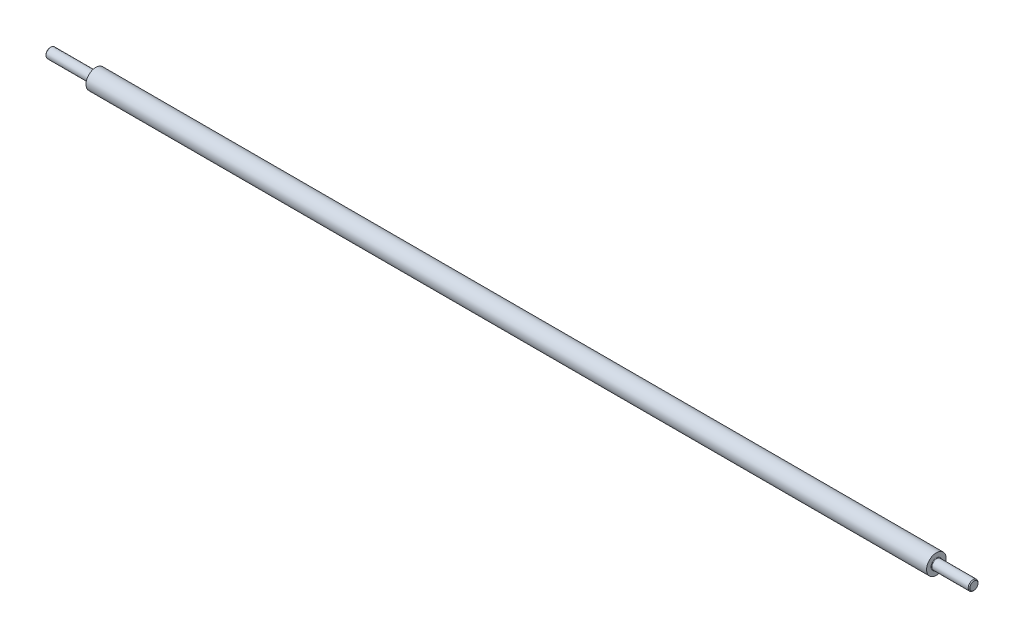
ISO-10303-21;
HEADER;
FILE_DESCRIPTION(('STEP AP214'),'2;1');
FILE_NAME('part.step','',(''),(''),'','','');
FILE_SCHEMA(('AUTOMOTIVE_DESIGN { 1 0 10303 214 1 1 1 1 }'));
ENDSEC;
DATA;
#1=APPLICATION_CONTEXT('core data for automotive mechanical design processes');
#2=APPLICATION_PROTOCOL_DEFINITION('international standard','automotive_design',2000,#1);
#3=PRODUCT_CONTEXT('',#1,'mechanical');
#4=PRODUCT('Part','Part','',(#3));
#5=PRODUCT_RELATED_PRODUCT_CATEGORY('part','',(#4));
#6=PRODUCT_DEFINITION_FORMATION('','',#4);
#7=PRODUCT_DEFINITION_CONTEXT('part definition',#1,'design');
#8=PRODUCT_DEFINITION('design','',#6,#7);
#9=PRODUCT_DEFINITION_SHAPE('','',#8);
#10=(LENGTH_UNIT() NAMED_UNIT(*) SI_UNIT(.MILLI.,.METRE.));
#11=(NAMED_UNIT(*) PLANE_ANGLE_UNIT() SI_UNIT($,.RADIAN.));
#12=(NAMED_UNIT(*) SI_UNIT($,.STERADIAN.) SOLID_ANGLE_UNIT());
#13=UNCERTAINTY_MEASURE_WITH_UNIT(LENGTH_MEASURE(1.E-05),#10,'distance_accuracy_value','');
#14=(GEOMETRIC_REPRESENTATION_CONTEXT(3) GLOBAL_UNCERTAINTY_ASSIGNED_CONTEXT((#13)) GLOBAL_UNIT_ASSIGNED_CONTEXT((#10,
#11,#12)) REPRESENTATION_CONTEXT('',''));
#15=CARTESIAN_POINT('',(0.,0.,0.));
#16=DIRECTION('',(0.,0.,1.));
#17=DIRECTION('',(1.,0.,0.));
#18=AXIS2_PLACEMENT_3D('',#15,#16,#17);
#19=CARTESIAN_POINT('',(-93.6000000000001,57.57,0.));
#20=DIRECTION('',(1.,0.,0.));
#21=DIRECTION('',(0.,1.,0.));
#22=AXIS2_PLACEMENT_3D('',#19,#20,#21);
#23=PLANE('',#22);
#24=CARTESIAN_POINT('',(-93.6000000000001,51.57,0.));
#25=DIRECTION('',(1.,0.,0.));
#26=DIRECTION('',(0.,1.,0.));
#27=AXIS2_PLACEMENT_3D('',#24,#25,#26);
#28=CIRCLE('',#27,3.29999999999997);
#29=CARTESIAN_POINT('',(-93.6000000000001,54.87,0.));
#30=VERTEX_POINT('',#29);
#31=EDGE_CURVE('E11',#30,#30,#28,.F.);
#32=ORIENTED_EDGE('',*,*,#31,.T.);
#33=EDGE_LOOP('',(#32));
#34=FACE_BOUND('',#33,.T.);
#35=CARTESIAN_POINT('',(-93.6000000000001,51.57,0.));
#36=DIRECTION('',(1.,0.,0.));
#37=DIRECTION('',(0.,1.,0.));
#38=AXIS2_PLACEMENT_3D('',#35,#36,#37);
#39=CIRCLE('',#38,5.99999999999998);
#40=CARTESIAN_POINT('',(-93.6000000000001,57.57,0.));
#41=VERTEX_POINT('',#40);
#42=EDGE_CURVE('E77',#41,#41,#39,.T.);
#43=ORIENTED_EDGE('',*,*,#42,.T.);
#44=EDGE_LOOP('',(#43));
#45=FACE_BOUND('',#44,.T.);
#46=ADVANCED_FACE('F45',(#34,#45),#23,.T.);
#47=CARTESIAN_POINT('',(-24.9606577642965,51.57,0.));
#48=DIRECTION('',(1.,0.,0.));
#49=DIRECTION('',(0.,1.,0.));
#50=AXIS2_PLACEMENT_3D('',#47,#48,#49);
#51=CYLINDRICAL_SURFACE('',#50,5.99999999999997);
#52=CARTESIAN_POINT('',(-608.6,51.57,0.));
#53=DIRECTION('',(1.,0.,0.));
#54=DIRECTION('',(0.,1.,0.));
#55=AXIS2_PLACEMENT_3D('',#52,#53,#54);
#56=CIRCLE('',#55,5.99999999999997);
#57=CARTESIAN_POINT('',(-608.6,57.5699999999999,0.));
#58=VERTEX_POINT('',#57);
#59=EDGE_CURVE('E80',#58,#58,#56,.T.);
#60=ORIENTED_EDGE('',*,*,#59,.T.);
#61=EDGE_LOOP('',(#60));
#62=FACE_BOUND('',#61,.T.);
#63=ORIENTED_EDGE('',*,*,#42,.F.);
#64=EDGE_LOOP('',(#63));
#65=FACE_BOUND('',#64,.T.);
#66=ADVANCED_FACE('F84',(#62,#65),#51,.T.);
#67=CARTESIAN_POINT('',(-608.6,57.5699999999999,0.));
#68=DIRECTION('',(-1.,0.,0.));
#69=DIRECTION('',(0.,-1.,0.));
#70=AXIS2_PLACEMENT_3D('',#67,#68,#69);
#71=PLANE('',#70);
#72=CARTESIAN_POINT('',(-608.6,51.57,0.));
#73=DIRECTION('',(-1.,0.,0.));
#74=DIRECTION('',(0.,-1.,0.));
#75=AXIS2_PLACEMENT_3D('',#72,#73,#74);
#76=CIRCLE('',#75,3.29999999999988);
#77=CARTESIAN_POINT('',(-608.6,48.2700000000001,0.));
#78=VERTEX_POINT('',#77);
#79=EDGE_CURVE('E60',#78,#78,#76,.F.);
#80=ORIENTED_EDGE('',*,*,#79,.T.);
#81=EDGE_LOOP('',(#80));
#82=FACE_BOUND('',#81,.T.);
#83=ORIENTED_EDGE('',*,*,#59,.F.);
#84=EDGE_LOOP('',(#83));
#85=FACE_BOUND('',#84,.T.);
#86=ADVANCED_FACE('F87',(#82,#85),#71,.T.);
#87=CARTESIAN_POINT('',(-24.9606577642965,51.57,0.));
#88=DIRECTION('',(1.,0.,0.));
#89=DIRECTION('',(0.,1.,0.));
#90=AXIS2_PLACEMENT_3D('',#87,#88,#89);
#91=CYLINDRICAL_SURFACE('',#90,2.99999999999988);
#92=CARTESIAN_POINT('',(-608.9,51.57,0.));
#93=DIRECTION('',(-1.,0.,0.));
#94=DIRECTION('',(0.,-1.,0.));
#95=AXIS2_PLACEMENT_3D('',#92,#93,#94);
#96=CIRCLE('',#95,2.99999999999988);
#97=CARTESIAN_POINT('',(-608.9,48.5700000000001,0.));
#98=VERTEX_POINT('',#97);
#99=EDGE_CURVE('E56',#98,#98,#96,.T.);
#100=ORIENTED_EDGE('',*,*,#99,.T.);
#101=EDGE_LOOP('',(#100));
#102=FACE_BOUND('',#101,.T.);
#103=CARTESIAN_POINT('',(-636.1,51.57,0.));
#104=DIRECTION('',(-1.,0.,0.));
#105=DIRECTION('',(0.,0.,1.));
#106=AXIS2_PLACEMENT_3D('',#103,#104,#105);
#107=CIRCLE('',#106,2.99999999999988);
#108=CARTESIAN_POINT('',(-636.1,51.57,2.99999999999988));
#109=VERTEX_POINT('',#108);
#110=EDGE_CURVE('E68',#109,#109,#107,.F.);
#111=ORIENTED_EDGE('',*,*,#110,.T.);
#112=EDGE_LOOP('',(#111));
#113=FACE_BOUND('',#112,.T.);
#114=ADVANCED_FACE('F89',(#102,#113),#91,.T.);
#115=CARTESIAN_POINT('',(-636.6,54.5699999999999,0.));
#116=DIRECTION('',(-1.,0.,0.));
#117=DIRECTION('',(0.,-1.,0.));
#118=AXIS2_PLACEMENT_3D('',#115,#116,#117);
#119=PLANE('',#118);
#120=CARTESIAN_POINT('',(-636.6,51.57,0.));
#121=DIRECTION('',(-1.,0.,0.));
#122=DIRECTION('',(0.,-1.,0.));
#123=AXIS2_PLACEMENT_3D('',#120,#121,#122);
#124=CIRCLE('',#123,2.49999999999977);
#125=CARTESIAN_POINT('',(-636.6,49.0700000000002,0.));
#126=VERTEX_POINT('',#125);
#127=EDGE_CURVE('E65',#126,#126,#124,.T.);
#128=ORIENTED_EDGE('',*,*,#127,.T.);
#129=EDGE_LOOP('',(#128));
#130=FACE_BOUND('',#129,.T.);
#131=ADVANCED_FACE('F96',(#130),#119,.T.);
#132=CARTESIAN_POINT('',(-70.6000000000001,54.57,0.));
#133=DIRECTION('',(1.,0.,0.));
#134=DIRECTION('',(0.,1.,0.));
#135=AXIS2_PLACEMENT_3D('',#132,#133,#134);
#136=PLANE('',#135);
#137=CARTESIAN_POINT('',(-70.6000000000001,51.57,0.));
#138=DIRECTION('',(1.,0.,0.));
#139=DIRECTION('',(0.,1.,0.));
#140=AXIS2_PLACEMENT_3D('',#137,#138,#139);
#141=CIRCLE('',#140,2.49999999999995);
#142=CARTESIAN_POINT('',(-70.6000000000001,54.07,0.));
#143=VERTEX_POINT('',#142);
#144=EDGE_CURVE('E74',#143,#143,#141,.T.);
#145=ORIENTED_EDGE('',*,*,#144,.T.);
#146=EDGE_LOOP('',(#145));
#147=FACE_BOUND('',#146,.T.);
#148=ADVANCED_FACE('F144',(#147),#136,.T.);
#149=CARTESIAN_POINT('',(-24.9606577642965,51.57,0.));
#150=DIRECTION('',(1.,0.,0.));
#151=DIRECTION('',(0.,1.,0.));
#152=AXIS2_PLACEMENT_3D('',#149,#150,#151);
#153=CYLINDRICAL_SURFACE('',#152,2.99999999999998);
#154=CARTESIAN_POINT('',(-93.3000000000001,51.57,0.));
#155=DIRECTION('',(1.,0.,0.));
#156=DIRECTION('',(0.,1.,0.));
#157=AXIS2_PLACEMENT_3D('',#154,#155,#156);
#158=CIRCLE('',#157,2.99999999999998);
#159=CARTESIAN_POINT('',(-93.3000000000001,54.57,0.));
#160=VERTEX_POINT('',#159);
#161=EDGE_CURVE('E52',#160,#160,#158,.T.);
#162=ORIENTED_EDGE('',*,*,#161,.T.);
#163=EDGE_LOOP('',(#162));
#164=FACE_BOUND('',#163,.T.);
#165=CARTESIAN_POINT('',(-71.1000000000002,51.57,0.));
#166=DIRECTION('',(1.,0.,0.));
#167=DIRECTION('',(0.,0.,-1.));
#168=AXIS2_PLACEMENT_3D('',#165,#166,#167);
#169=CIRCLE('',#168,2.99999999999998);
#170=CARTESIAN_POINT('',(-71.1000000000002,51.57,-2.99999999999998));
#171=VERTEX_POINT('',#170);
#172=EDGE_CURVE('E71',#171,#171,#169,.F.);
#173=ORIENTED_EDGE('',*,*,#172,.T.);
#174=EDGE_LOOP('',(#173));
#175=FACE_BOUND('',#174,.T.);
#176=ADVANCED_FACE('F110',(#164,#175),#153,.T.);
#177=CARTESIAN_POINT('',(-70.6000000000001,51.57,0.));
#178=DIRECTION('',(-1.,0.,0.));
#179=DIRECTION('',(0.,0.,1.));
#180=AXIS2_PLACEMENT_3D('',#177,#178,#179);
#181=CONICAL_SURFACE('',#180,2.49999999999995,0.78539816339746);
#182=ORIENTED_EDGE('',*,*,#172,.F.);
#183=EDGE_LOOP('',(#182));
#184=FACE_BOUND('',#183,.T.);
#185=ORIENTED_EDGE('',*,*,#144,.F.);
#186=EDGE_LOOP('',(#185));
#187=FACE_BOUND('',#186,.T.);
#188=ADVANCED_FACE('F106',(#184,#187),#181,.T.);
#189=CARTESIAN_POINT('',(-636.1,51.57,0.));
#190=DIRECTION('',(1.,0.,0.));
#191=DIRECTION('',(0.,0.,-1.));
#192=AXIS2_PLACEMENT_3D('',#189,#190,#191);
#193=CONICAL_SURFACE('',#192,2.99999999999988,0.7853981633975);
#194=ORIENTED_EDGE('',*,*,#127,.F.);
#195=EDGE_LOOP('',(#194));
#196=FACE_BOUND('',#195,.T.);
#197=ORIENTED_EDGE('',*,*,#110,.F.);
#198=EDGE_LOOP('',(#197));
#199=FACE_BOUND('',#198,.T.);
#200=ADVANCED_FACE('F109',(#196,#199),#193,.T.);
#201=CARTESIAN_POINT('',(-608.9,51.57,0.));
#202=DIRECTION('',(-1.,0.,0.));
#203=DIRECTION('',(0.,-1.,0.));
#204=AXIS2_PLACEMENT_3D('',#201,#202,#203);
#205=TOROIDAL_SURFACE('',#204,3.29999999999988,0.3);
#206=ORIENTED_EDGE('',*,*,#99,.F.);
#207=EDGE_LOOP('',(#206));
#208=FACE_BOUND('',#207,.T.);
#209=ORIENTED_EDGE('',*,*,#79,.F.);
#210=EDGE_LOOP('',(#209));
#211=FACE_BOUND('',#210,.T.);
#212=ADVANCED_FACE('F113',(#208,#211),#205,.F.);
#213=CARTESIAN_POINT('',(-93.3000000000001,51.57,0.));
#214=DIRECTION('',(1.,0.,0.));
#215=DIRECTION('',(0.,1.,0.));
#216=AXIS2_PLACEMENT_3D('',#213,#214,#215);
#217=TOROIDAL_SURFACE('',#216,3.29999999999997,0.3);
#218=ORIENTED_EDGE('',*,*,#31,.F.);
#219=EDGE_LOOP('',(#218));
#220=FACE_BOUND('',#219,.T.);
#221=ORIENTED_EDGE('',*,*,#161,.F.);
#222=EDGE_LOOP('',(#221));
#223=FACE_BOUND('',#222,.T.);
#224=ADVANCED_FACE('F47',(#220,#223),#217,.F.);
#225=CLOSED_SHELL('',(#46,#66,#86,#114,#131,#148,#176,#188,#200,#212,#224));
#226=MANIFOLD_SOLID_BREP('B2',#225);
#227=ADVANCED_BREP_SHAPE_REPRESENTATION('',(#18,#226),#14);
#228=SHAPE_DEFINITION_REPRESENTATION(#9,#227);
ENDSEC;
END-ISO-10303-21;
